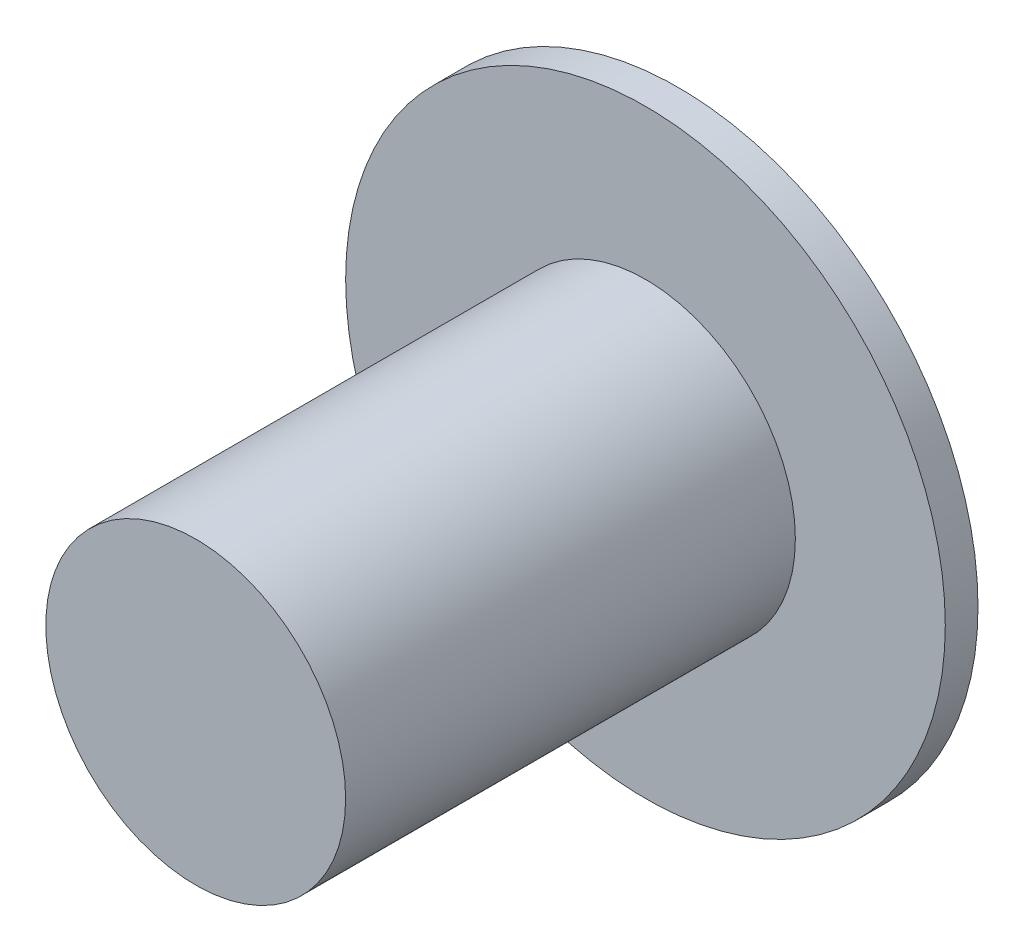
ISO-10303-21;
HEADER;
FILE_DESCRIPTION(('STEP AP214'),'2;1');
FILE_NAME('part.step','',(''),(''),'','','');
FILE_SCHEMA(('AUTOMOTIVE_DESIGN { 1 0 10303 214 1 1 1 1 }'));
ENDSEC;
DATA;
#1=APPLICATION_CONTEXT('core data for automotive mechanical design processes');
#2=APPLICATION_PROTOCOL_DEFINITION('international standard','automotive_design',2000,#1);
#3=PRODUCT_CONTEXT('',#1,'mechanical');
#4=PRODUCT('Part','Part','',(#3));
#5=PRODUCT_RELATED_PRODUCT_CATEGORY('part','',(#4));
#6=PRODUCT_DEFINITION_FORMATION('','',#4);
#7=PRODUCT_DEFINITION_CONTEXT('part definition',#1,'design');
#8=PRODUCT_DEFINITION('design','',#6,#7);
#9=PRODUCT_DEFINITION_SHAPE('','',#8);
#10=(LENGTH_UNIT() NAMED_UNIT(*) SI_UNIT(.MILLI.,.METRE.));
#11=(NAMED_UNIT(*) PLANE_ANGLE_UNIT() SI_UNIT($,.RADIAN.));
#12=(NAMED_UNIT(*) SI_UNIT($,.STERADIAN.) SOLID_ANGLE_UNIT());
#13=UNCERTAINTY_MEASURE_WITH_UNIT(LENGTH_MEASURE(1.E-05),#10,'distance_accuracy_value','');
#14=(GEOMETRIC_REPRESENTATION_CONTEXT(3) GLOBAL_UNCERTAINTY_ASSIGNED_CONTEXT((#13)) GLOBAL_UNIT_ASSIGNED_CONTEXT((#10,
#11,#12)) REPRESENTATION_CONTEXT('',''));
#15=CARTESIAN_POINT('',(0.,0.,0.));
#16=DIRECTION('',(0.,0.,1.));
#17=DIRECTION('',(1.,0.,0.));
#18=AXIS2_PLACEMENT_3D('',#15,#16,#17);
#19=CARTESIAN_POINT('',(0.,0.,5.));
#20=DIRECTION('',(0.,0.,-1.));
#21=DIRECTION('',(-1.,0.,0.));
#22=AXIS2_PLACEMENT_3D('',#19,#20,#21);
#23=CYLINDRICAL_SURFACE('',#22,11.);
#24=CARTESIAN_POINT('',(0.,0.,5.));
#25=DIRECTION('',(0.,0.,1.));
#26=DIRECTION('',(1.,0.,0.));
#27=AXIS2_PLACEMENT_3D('',#24,#25,#26);
#28=CIRCLE('',#27,11.);
#29=CARTESIAN_POINT('',(11.,0.,5.));
#30=VERTEX_POINT('',#29);
#31=EDGE_CURVE('E42',#30,#30,#28,.T.);
#32=ORIENTED_EDGE('',*,*,#31,.F.);
#33=EDGE_LOOP('',(#32));
#34=FACE_BOUND('',#33,.T.);
#35=CARTESIAN_POINT('',(0.,0.,0.));
#36=DIRECTION('',(0.,0.,1.));
#37=DIRECTION('',(1.,0.,0.));
#38=AXIS2_PLACEMENT_3D('',#35,#36,#37);
#39=CIRCLE('',#38,11.);
#40=CARTESIAN_POINT('',(11.,0.,0.));
#41=VERTEX_POINT('',#40);
#42=EDGE_CURVE('E38',#41,#41,#39,.T.);
#43=ORIENTED_EDGE('',*,*,#42,.T.);
#44=EDGE_LOOP('',(#43));
#45=FACE_BOUND('',#44,.T.);
#46=ADVANCED_FACE('F35',(#34,#45),#23,.T.);
#47=CARTESIAN_POINT('',(0.,0.,0.));
#48=DIRECTION('',(0.,0.,1.));
#49=DIRECTION('',(1.,0.,0.));
#50=AXIS2_PLACEMENT_3D('',#47,#48,#49);
#51=PLANE('',#50);
#52=ORIENTED_EDGE('',*,*,#42,.F.);
#53=EDGE_LOOP('',(#52));
#54=FACE_BOUND('',#53,.T.);
#55=ADVANCED_FACE('F76',(#54),#51,.F.);
#56=CARTESIAN_POINT('',(0.,0.,7.4));
#57=DIRECTION('',(0.,0.,-1.));
#58=DIRECTION('',(-1.,0.,0.));
#59=AXIS2_PLACEMENT_3D('',#56,#57,#58);
#60=CYLINDRICAL_SURFACE('',#59,21.999999942);
#61=CARTESIAN_POINT('',(0.,0.,7.4));
#62=DIRECTION('',(0.,0.,1.));
#63=DIRECTION('',(1.,0.,0.));
#64=AXIS2_PLACEMENT_3D('',#61,#62,#63);
#65=CIRCLE('',#64,21.999999942);
#66=CARTESIAN_POINT('',(21.999999942,0.,7.4));
#67=VERTEX_POINT('',#66);
#68=EDGE_CURVE('E50',#67,#67,#65,.T.);
#69=ORIENTED_EDGE('',*,*,#68,.F.);
#70=EDGE_LOOP('',(#69));
#71=FACE_BOUND('',#70,.T.);
#72=CARTESIAN_POINT('',(0.,0.,5.));
#73=DIRECTION('',(0.,0.,1.));
#74=DIRECTION('',(1.,0.,0.));
#75=AXIS2_PLACEMENT_3D('',#72,#73,#74);
#76=CIRCLE('',#75,21.999999942);
#77=CARTESIAN_POINT('',(21.999999942,0.,5.));
#78=VERTEX_POINT('',#77);
#79=EDGE_CURVE('E53',#78,#78,#76,.T.);
#80=ORIENTED_EDGE('',*,*,#79,.T.);
#81=EDGE_LOOP('',(#80));
#82=FACE_BOUND('',#81,.T.);
#83=ADVANCED_FACE('F81',(#71,#82),#60,.T.);
#84=CARTESIAN_POINT('',(0.,0.,7.4));
#85=DIRECTION('',(0.,0.,1.));
#86=DIRECTION('',(1.,0.,0.));
#87=AXIS2_PLACEMENT_3D('',#84,#85,#86);
#88=PLANE('',#87);
#89=CARTESIAN_POINT('',(0.,0.,7.4));
#90=DIRECTION('',(0.,0.,1.));
#91=DIRECTION('',(1.,0.,0.));
#92=AXIS2_PLACEMENT_3D('',#89,#90,#91);
#93=CIRCLE('',#92,11.);
#94=CARTESIAN_POINT('',(11.,0.,7.4));
#95=VERTEX_POINT('',#94);
#96=EDGE_CURVE('E10',#95,#95,#93,.T.);
#97=ORIENTED_EDGE('',*,*,#96,.F.);
#98=EDGE_LOOP('',(#97));
#99=FACE_BOUND('',#98,.T.);
#100=ORIENTED_EDGE('',*,*,#68,.T.);
#101=EDGE_LOOP('',(#100));
#102=FACE_BOUND('',#101,.T.);
#103=ADVANCED_FACE('F71',(#99,#102),#88,.T.);
#104=CARTESIAN_POINT('',(0.,0.,5.));
#105=DIRECTION('',(0.,0.,1.));
#106=DIRECTION('',(1.,0.,0.));
#107=AXIS2_PLACEMENT_3D('',#104,#105,#106);
#108=PLANE('',#107);
#109=ORIENTED_EDGE('',*,*,#31,.T.);
#110=EDGE_LOOP('',(#109));
#111=FACE_BOUND('',#110,.T.);
#112=ORIENTED_EDGE('',*,*,#79,.F.);
#113=EDGE_LOOP('',(#112));
#114=FACE_BOUND('',#113,.T.);
#115=ADVANCED_FACE('F64',(#111,#114),#108,.F.);
#116=CARTESIAN_POINT('',(0.,0.,40.4));
#117=DIRECTION('',(0.,0.,-1.));
#118=DIRECTION('',(-1.,0.,0.));
#119=AXIS2_PLACEMENT_3D('',#116,#117,#118);
#120=CYLINDRICAL_SURFACE('',#119,11.);
#121=CARTESIAN_POINT('',(0.,0.,40.4));
#122=DIRECTION('',(0.,0.,1.));
#123=DIRECTION('',(1.,0.,0.));
#124=AXIS2_PLACEMENT_3D('',#121,#122,#123);
#125=CIRCLE('',#124,11.);
#126=CARTESIAN_POINT('',(11.,0.,40.4));
#127=VERTEX_POINT('',#126);
#128=EDGE_CURVE('E49',#127,#127,#125,.T.);
#129=ORIENTED_EDGE('',*,*,#128,.F.);
#130=EDGE_LOOP('',(#129));
#131=FACE_BOUND('',#130,.T.);
#132=ORIENTED_EDGE('',*,*,#96,.T.);
#133=EDGE_LOOP('',(#132));
#134=FACE_BOUND('',#133,.T.);
#135=ADVANCED_FACE('F62',(#131,#134),#120,.T.);
#136=CARTESIAN_POINT('',(0.,0.,40.4));
#137=DIRECTION('',(0.,0.,1.));
#138=DIRECTION('',(1.,0.,0.));
#139=AXIS2_PLACEMENT_3D('',#136,#137,#138);
#140=PLANE('',#139);
#141=ORIENTED_EDGE('',*,*,#128,.T.);
#142=EDGE_LOOP('',(#141));
#143=FACE_BOUND('',#142,.T.);
#144=ADVANCED_FACE('F60',(#143),#140,.T.);
#145=CLOSED_SHELL('',(#46,#55,#83,#103,#115,#135,#144));
#146=MANIFOLD_SOLID_BREP('B2',#145);
#147=ADVANCED_BREP_SHAPE_REPRESENTATION('',(#18,#146),#14);
#148=SHAPE_DEFINITION_REPRESENTATION(#9,#147);
ENDSEC;
END-ISO-10303-21;
